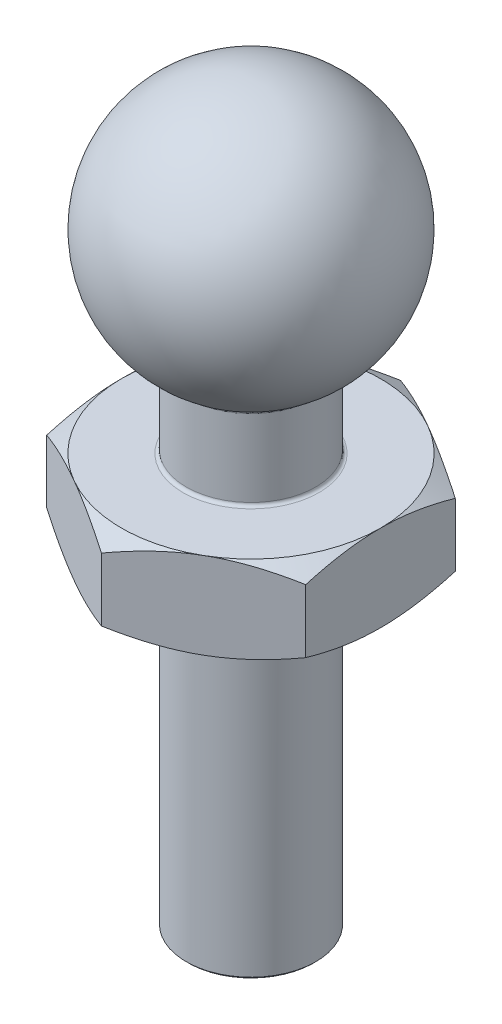
ISO-10303-21;
HEADER;
FILE_DESCRIPTION(('STEP AP214'),'2;1');
FILE_NAME('part.step','',(''),(''),'','','');
FILE_SCHEMA(('AUTOMOTIVE_DESIGN { 1 0 10303 214 1 1 1 1 }'));
ENDSEC;
DATA;
#1=APPLICATION_CONTEXT('core data for automotive mechanical design processes');
#2=APPLICATION_PROTOCOL_DEFINITION('international standard','automotive_design',2000,#1);
#3=PRODUCT_CONTEXT('',#1,'mechanical');
#4=PRODUCT('Part','Part','',(#3));
#5=PRODUCT_RELATED_PRODUCT_CATEGORY('part','',(#4));
#6=PRODUCT_DEFINITION_FORMATION('','',#4);
#7=PRODUCT_DEFINITION_CONTEXT('part definition',#1,'design');
#8=PRODUCT_DEFINITION('design','',#6,#7);
#9=PRODUCT_DEFINITION_SHAPE('','',#8);
#10=(LENGTH_UNIT() NAMED_UNIT(*) SI_UNIT(.MILLI.,.METRE.));
#11=(NAMED_UNIT(*) PLANE_ANGLE_UNIT() SI_UNIT($,.RADIAN.));
#12=(NAMED_UNIT(*) SI_UNIT($,.STERADIAN.) SOLID_ANGLE_UNIT());
#13=UNCERTAINTY_MEASURE_WITH_UNIT(LENGTH_MEASURE(1.E-05),#10,'distance_accuracy_value','');
#14=(GEOMETRIC_REPRESENTATION_CONTEXT(3) GLOBAL_UNCERTAINTY_ASSIGNED_CONTEXT((#13)) GLOBAL_UNIT_ASSIGNED_CONTEXT((#10,
#11,#12)) REPRESENTATION_CONTEXT('',''));
#15=CARTESIAN_POINT('',(0.,0.,0.));
#16=DIRECTION('',(0.,0.,1.));
#17=DIRECTION('',(1.,0.,0.));
#18=AXIS2_PLACEMENT_3D('',#15,#16,#17);
#19=CARTESIAN_POINT('',(-3.,9.5,-1.73205080756888));
#20=DIRECTION('',(1.,0.,0.));
#21=DIRECTION('',(0.,0.,-1.));
#22=AXIS2_PLACEMENT_3D('',#19,#20,#21);
#23=PLANE('',#22);
#24=CARTESIAN_POINT('',(-3.,7.49669275597267,-5.73225080756888));
#25=CARTESIAN_POINT('',(-3.,7.56535762873895,-5.59799811373669));
#26=CARTESIAN_POINT('',(-3.,7.63362658074956,-5.46354106552017));
#27=CARTESIAN_POINT('',(-3.,7.7691751977503,-5.19412594711895));
#28=CARTESIAN_POINT('',(-3.,7.83645484167597,-5.05916786634262));
#29=CARTESIAN_POINT('',(-3.,7.96993872408742,-4.78843231789163));
#30=CARTESIAN_POINT('',(-3.,8.0361409223391,-4.65265384244874));
#31=CARTESIAN_POINT('',(-3.,8.16708055525372,-4.38038885038151));
#32=CARTESIAN_POINT('',(-3.,8.23181796851999,-4.24390232345014));
#33=CARTESIAN_POINT('',(-3.,8.36273075239076,-3.96310511366176));
#34=CARTESIAN_POINT('',(-3.,8.42881132731156,-3.81875010473635));
#35=CARTESIAN_POINT('',(-3.,8.55842928727965,-3.52890389215656));
#36=CARTESIAN_POINT('',(-3.,8.62196674541402,-3.38341272129836));
#37=CARTESIAN_POINT('',(-3.,8.74573518476893,-3.0911428032025));
#38=CARTESIAN_POINT('',(-3.,8.80596844827942,-2.94436502804428));
#39=CARTESIAN_POINT('',(-3.,8.92221294586851,-2.64909731827644));
#40=CARTESIAN_POINT('',(-3.,8.97822314680859,-2.50060697487877));
#41=CARTESIAN_POINT('',(-3.,9.09420348606466,-2.17495473766773));
#42=CARTESIAN_POINT('',(-3.,9.15309774811246,-1.99740334689548));
#43=CARTESIAN_POINT('',(-3.,9.26029523419006,-1.63917764376158));
#44=CARTESIAN_POINT('',(-3.,9.30860404614459,-1.45850503366086));
#45=CARTESIAN_POINT('',(-3.,9.39023263279609,-1.09720914532956));
#46=CARTESIAN_POINT('',(-3.,9.42381477693698,-0.916647599895754));
#47=CARTESIAN_POINT('',(-3.,9.46126742176692,-0.644079261802784));
#48=CARTESIAN_POINT('',(-3.,9.47159787377878,-0.552943422867091));
#49=CARTESIAN_POINT('',(-3.,9.48763454600052,-0.370270654947725));
#50=CARTESIAN_POINT('',(-3.,9.49334144079801,-0.278733786435306));
#51=CARTESIAN_POINT('',(-3.,9.49996614854262,-0.094407851772205));
#52=CARTESIAN_POINT('',(-3.,9.5008268616344,-0.00161671746075657));
#53=CARTESIAN_POINT('',(-3.,9.49757525562797,0.183877598413804));
#54=CARTESIAN_POINT('',(-3.,9.49346292019229,0.276580779686972));
#55=CARTESIAN_POINT('',(-3.,9.48041370767168,0.461668088480519));
#56=CARTESIAN_POINT('',(-3.,9.47147558711607,0.554052127589447));
#57=CARTESIAN_POINT('',(-3.,9.4490819835307,0.738276464049778));
#58=CARTESIAN_POINT('',(-3.,9.43562578745625,0.830116673244047));
#59=CARTESIAN_POINT('',(-3.,9.38848678345653,1.1081241349506));
#60=CARTESIAN_POINT('',(-3.,9.34831083516922,1.2932028927465));
#61=CARTESIAN_POINT('',(-3.,9.25483304091392,1.65992833453579));
#62=CARTESIAN_POINT('',(-3.,9.2015281748169,1.8415742184766));
#63=CARTESIAN_POINT('',(-3.,9.09001482170302,2.18718321983853));
#64=CARTESIAN_POINT('',(-3.,9.03254960886738,2.35139002090274));
#65=CARTESIAN_POINT('',(-3.,8.91157770593576,2.67757637701536));
#66=CARTESIAN_POINT('',(-3.,8.84806982210383,2.83955548471668));
#67=CARTESIAN_POINT('',(-3.,8.71649668995848,3.16180541641892));
#68=CARTESIAN_POINT('',(-3.,8.64842746398322,3.32207460435457));
#69=CARTESIAN_POINT('',(-3.,8.50888164672137,3.64112437712565));
#70=CARTESIAN_POINT('',(-3.,8.43740489080743,3.79990488959462));
#71=CARTESIAN_POINT('',(-3.,8.29572041514807,4.10783154121877));
#72=CARTESIAN_POINT('',(-3.,8.22564804300012,4.25704019529893));
#73=CARTESIAN_POINT('',(-3.,8.0836551872923,4.55457880885657));
#74=CARTESIAN_POINT('',(-3.,8.01173465191385,4.70290874355283));
#75=CARTESIAN_POINT('',(-3.,7.86663085724281,4.99841900754648));
#76=CARTESIAN_POINT('',(-3.,7.79345182235509,5.14560141584992));
#77=CARTESIAN_POINT('',(-3.,7.64590152942626,5.43935321353677));
#78=CARTESIAN_POINT('',(-3.,7.57153036655204,5.58592265068707));
#79=CARTESIAN_POINT('',(-3.,7.49669275597267,5.73225080756888));
#80=B_SPLINE_CURVE_WITH_KNOTS('',3,(#24,#25,#26,#27,#28,#29,#30,#31,#32,#33,#34,#35,#36,#37,#38,
#39,#40,#41,#42,#43,#44,#45,#46,#47,#48,#49,#50,#51,#52,#53,#54,#55,#56,#57,#58,#59,#60,#61,#62,
#63,#64,#65,#66,#67,#68,#69,#70,#71,#72,#73,#74,#75,#76,#77,#78,#79),.UNSPECIFIED.,.F.,.F.,(4,2,
2,2,2,2,2,2,2,2,2,2,2,2,2,2,2,2,2,2,2,2,2,2,2,2,2,4),(0.,0.452382016001322,0.904773650265349,
1.35794045354517,1.81111387213612,2.2873771437625,2.76362671813268,3.23954308217786,
3.71557550010852,4.27652369616462,4.83717505756687,5.38738613645124,5.66244417939779,
5.937462083513,6.21571369559986,6.4939662218021,6.77229048018743,7.05065868449287,
7.61810965270507,8.18569127741244,8.70745206667822,9.2293161451901,9.75164138486645,
10.2739918851653,10.7685068932809,11.2630357817083,11.756143015984,12.2492110799155),.UNSPECIFIED.);
#81=CARTESIAN_POINT('',(-3.,9.23205080756888,-1.73205080756888));
#82=VERTEX_POINT('',#81);
#83=CARTESIAN_POINT('',(-3.,9.5,0.));
#84=VERTEX_POINT('',#83);
#85=EDGE_CURVE('E230',#82,#84,#80,.T.);
#86=ORIENTED_EDGE('',*,*,#85,.F.);
#87=DIRECTION('',(0.,-1.,0.));
#88=VECTOR('',#87,1.);
#89=CARTESIAN_POINT('',(-3.,9.5,-1.73205080756888));
#90=LINE('',#89,#88);
#91=CARTESIAN_POINT('',(-3.,7.7679491924311,-1.73205080756891));
#92=VERTEX_POINT('',#91);
#93=EDGE_CURVE('E176',#82,#92,#90,.T.);
#94=ORIENTED_EDGE('',*,*,#93,.T.);
#95=CARTESIAN_POINT('',(-3.,9.50330724402733,5.73225080756888));
#96=CARTESIAN_POINT('',(-3.,9.43464237126105,5.59799811373669));
#97=CARTESIAN_POINT('',(-3.,9.36637341925044,5.46354106552017));
#98=CARTESIAN_POINT('',(-3.,9.2308248022497,5.19412594711895));
#99=CARTESIAN_POINT('',(-3.,9.16354515832403,5.05916786634261));
#100=CARTESIAN_POINT('',(-3.,9.03006127591258,4.78843231789162));
#101=CARTESIAN_POINT('',(-3.,8.9638590776609,4.65265384244874));
#102=CARTESIAN_POINT('',(-3.,8.83291944474628,4.38038885038151));
#103=CARTESIAN_POINT('',(-3.,8.76818203148001,4.24390232345014));
#104=CARTESIAN_POINT('',(-3.,8.63726924760924,3.96310511366176));
#105=CARTESIAN_POINT('',(-3.,8.57118867268844,3.81875010473635));
#106=CARTESIAN_POINT('',(-3.,8.44157071272035,3.52890389215656));
#107=CARTESIAN_POINT('',(-3.,8.37803325458598,3.38341272129836));
#108=CARTESIAN_POINT('',(-3.,8.25426481523107,3.0911428032025));
#109=CARTESIAN_POINT('',(-3.,8.19403155172058,2.94436502804428));
#110=CARTESIAN_POINT('',(-3.,8.07778705413149,2.64909731827644));
#111=CARTESIAN_POINT('',(-3.,8.02177685319141,2.50060697487877));
#112=CARTESIAN_POINT('',(-3.,7.90579651393534,2.17495473766773));
#113=CARTESIAN_POINT('',(-3.,7.84690225188754,1.99740334689548));
#114=CARTESIAN_POINT('',(-3.,7.73970476580994,1.63917764376158));
#115=CARTESIAN_POINT('',(-3.,7.69139595385541,1.45850503366086));
#116=CARTESIAN_POINT('',(-3.,7.60976736720391,1.09720914532956));
#117=CARTESIAN_POINT('',(-3.,7.57618522306301,0.916647599895755));
#118=CARTESIAN_POINT('',(-3.,7.53873257823308,0.644079261802785));
#119=CARTESIAN_POINT('',(-3.,7.52840212622122,0.552943422867092));
#120=CARTESIAN_POINT('',(-3.,7.51236545399948,0.370270654947726));
#121=CARTESIAN_POINT('',(-3.,7.50665855920199,0.278733786435307));
#122=CARTESIAN_POINT('',(-3.,7.50003385145738,0.0944078517722066));
#123=CARTESIAN_POINT('',(-3.,7.4991731383656,0.00161671746075791));
#124=CARTESIAN_POINT('',(-3.,7.50242474437203,-0.183877598413803));
#125=CARTESIAN_POINT('',(-3.,7.50653707980771,-0.27658077968697));
#126=CARTESIAN_POINT('',(-3.,7.51958629232832,-0.461668088480517));
#127=CARTESIAN_POINT('',(-3.,7.52852441288393,-0.554052127589444));
#128=CARTESIAN_POINT('',(-3.,7.5509180164693,-0.738276464049775));
#129=CARTESIAN_POINT('',(-3.,7.56437421254374,-0.830116673244044));
#130=CARTESIAN_POINT('',(-3.,7.61151321654347,-1.1081241349506));
#131=CARTESIAN_POINT('',(-3.,7.65168916483078,-1.29320289274649));
#132=CARTESIAN_POINT('',(-3.,7.74516695908608,-1.65992833453579));
#133=CARTESIAN_POINT('',(-3.,7.79847182518309,-1.8415742184766));
#134=CARTESIAN_POINT('',(-3.,7.90998517829698,-2.18718321983853));
#135=CARTESIAN_POINT('',(-3.,7.96745039113262,-2.35139002090274));
#136=CARTESIAN_POINT('',(-3.,8.08842229406423,-2.67757637701535));
#137=CARTESIAN_POINT('',(-3.,8.15193017789617,-2.83955548471668));
#138=CARTESIAN_POINT('',(-3.,8.28350331004152,-3.16180541641892));
#139=CARTESIAN_POINT('',(-3.,8.35157253601677,-3.32207460435457));
#140=CARTESIAN_POINT('',(-3.,8.49111835327863,-3.64112437712565));
#141=CARTESIAN_POINT('',(-3.,8.56259510919257,-3.79990488959461));
#142=CARTESIAN_POINT('',(-3.,8.70427958485193,-4.10783154121877));
#143=CARTESIAN_POINT('',(-3.,8.77435195699988,-4.25704019529893));
#144=CARTESIAN_POINT('',(-3.,8.9163448127077,-4.55457880885657));
#145=CARTESIAN_POINT('',(-3.,8.98826534808616,-4.70290874355283));
#146=CARTESIAN_POINT('',(-3.,9.13336914275719,-4.99841900754647));
#147=CARTESIAN_POINT('',(-3.,9.20654817764491,-5.14560141584992));
#148=CARTESIAN_POINT('',(-3.,9.35409847057374,-5.43935321353677));
#149=CARTESIAN_POINT('',(-3.,9.42846963344796,-5.58592265068707));
#150=CARTESIAN_POINT('',(-3.,9.50330724402733,-5.73225080756888));
#151=B_SPLINE_CURVE_WITH_KNOTS('',3,(#95,#96,#97,#98,#99,#100,#101,#102,#103,#104,#105,#106,
#107,#108,#109,#110,#111,#112,#113,#114,#115,#116,#117,#118,#119,#120,#121,#122,#123,#124,#125,
#126,#127,#128,#129,#130,#131,#132,#133,#134,#135,#136,#137,#138,#139,#140,#141,#142,#143,#144,
#145,#146,#147,#148,#149,#150),.UNSPECIFIED.,.F.,.F.,(4,2,2,2,2,2,2,2,2,2,2,2,2,2,2,2,2,2,2,2,2,
2,2,2,2,2,2,4),(0.,0.452382016001321,0.90477365026535,1.35794045354517,1.81111387213612,
2.2873771437625,2.76362671813268,3.23954308217786,3.71557550010852,4.27652369616462,
4.83717505756687,5.38738613645124,5.66244417939779,5.937462083513,6.21571369559986,
6.4939662218021,6.77229048018743,7.05065868449287,7.61810965270507,8.18569127741243,
8.70745206667821,9.2293161451901,9.75164138486645,10.2739918851653,10.7685068932809,
11.2630357817083,11.756143015984,12.2492110799155),.UNSPECIFIED.);
#152=CARTESIAN_POINT('',(-3.,7.5,0.));
#153=VERTEX_POINT('',#152);
#154=EDGE_CURVE('E237',#153,#92,#151,.T.);
#155=ORIENTED_EDGE('',*,*,#154,.F.);
#156=CARTESIAN_POINT('',(-3.,7.76794919243112,1.73205080756888));
#157=VERTEX_POINT('',#156);
#158=EDGE_CURVE('E244',#157,#153,#151,.T.);
#159=ORIENTED_EDGE('',*,*,#158,.F.);
#160=DIRECTION('',(0.,-1.,0.));
#161=VECTOR('',#160,1.);
#162=CARTESIAN_POINT('',(-3.,9.5,1.73205080756888));
#163=LINE('',#162,#161);
#164=CARTESIAN_POINT('',(-3.,9.23205080756888,1.73205080756888));
#165=VERTEX_POINT('',#164);
#166=EDGE_CURVE('E259',#165,#157,#163,.T.);
#167=ORIENTED_EDGE('',*,*,#166,.F.);
#168=EDGE_CURVE('E161',#84,#165,#80,.T.);
#169=ORIENTED_EDGE('',*,*,#168,.F.);
#170=EDGE_LOOP('',(#86,#94,#155,#159,#167,#169));
#171=FACE_BOUND('',#170,.T.);
#172=ADVANCED_FACE('F38',(#171),#23,.F.);
#173=CARTESIAN_POINT('',(0.,9.5,-3.46410161513776));
#174=DIRECTION('',(0.5,0.,0.866025403784439));
#175=DIRECTION('',(0.866025403784438,0.,-0.5));
#176=AXIS2_PLACEMENT_3D('',#173,#174,#175);
#177=PLANE('',#176);
#178=CARTESIAN_POINT('',(0.00020000000000006,9.23198413756899,-3.46421708519159));
#179=CARTESIAN_POINT('',(-0.131635206588332,9.27594629554769,-3.38810199317915));
#180=CARTESIAN_POINT('',(-0.264608405355249,9.31592841370737,-3.31132988107607));
#181=CARTESIAN_POINT('',(-0.532857420002056,9.38571791955454,-3.15645624025988));
#182=CARTESIAN_POINT('',(-0.668138002634342,9.41550061773462,-3.078351959461));
#183=CARTESIAN_POINT('',(-0.937022602096483,9.46186216078874,-2.92311136358059));
#184=CARTESIAN_POINT('',(-1.07058524542946,9.47874955887705,-2.84599893549861));
#185=CARTESIAN_POINT('',(-1.33833905729569,9.49891035755148,-2.6914112001411));
#186=CARTESIAN_POINT('',(-1.47252925247984,9.50220045221892,-2.61393645482892));
#187=CARTESIAN_POINT('',(-1.72327559769581,9.49535946911461,-2.46916798492017));
#188=CARTESIAN_POINT('',(-1.83986926497268,9.48690808580738,-2.40185259973206));
#189=CARTESIAN_POINT('',(-2.07229698497464,9.46012105699296,-2.2676603930218));
#190=CARTESIAN_POINT('',(-2.18813023365133,9.44177625913829,-2.2007840357172));
#191=CARTESIAN_POINT('',(-2.42103725705637,9.39591524914667,-2.06631510305815));
#192=CARTESIAN_POINT('',(-2.53808155051394,9.36820461473692,-1.99873954872331));
#193=CARTESIAN_POINT('',(-2.77042435049913,9.3053122048626,-1.86459637060759));
#194=CARTESIAN_POINT('',(-2.88572583417111,9.27014520897844,-1.79802702797161));
#195=CARTESIAN_POINT('',(-3.0002,9.23198413756899,-1.73193533751504));
#196=B_SPLINE_CURVE_WITH_KNOTS('',3,(#178,#179,#180,#181,#182,#183,#184,#185,#186,#187,#188,
#189,#190,#191,#192,#193,#194,#195),.UNSPECIFIED.,.F.,.F.,(4,2,2,2,2,2,2,2,4),(0.,
0.475539830103041,0.952222784107964,1.41710776961288,1.88142182298026,2.28572436316091,
2.69040156475039,3.10405572063576,3.5168974940707),.UNSPECIFIED.);
#197=CARTESIAN_POINT('',(0.,9.23205080756888,-3.46410161513776));
#198=VERTEX_POINT('',#197);
#199=CARTESIAN_POINT('',(-1.5,9.5,-2.59807621135332));
#200=VERTEX_POINT('',#199);
#201=EDGE_CURVE('E156',#198,#200,#196,.T.);
#202=ORIENTED_EDGE('',*,*,#201,.F.);
#203=DIRECTION('',(0.,-1.,0.));
#204=VECTOR('',#203,1.);
#205=CARTESIAN_POINT('',(0.,9.5,-3.46410161513776));
#206=LINE('',#205,#204);
#207=CARTESIAN_POINT('',(0.,7.76794919243112,-3.46410161513776));
#208=VERTEX_POINT('',#207);
#209=EDGE_CURVE('E256',#198,#208,#206,.T.);
#210=ORIENTED_EDGE('',*,*,#209,.T.);
#211=CARTESIAN_POINT('',(-3.0002,7.76801586243101,-1.73193533751504));
#212=CARTESIAN_POINT('',(-2.86836479341167,7.72405370445231,-1.80805042952748));
#213=CARTESIAN_POINT('',(-2.73539159464475,7.68407158629263,-1.88482254163057));
#214=CARTESIAN_POINT('',(-2.46714257999795,7.61428208044547,-2.03969618244675));
#215=CARTESIAN_POINT('',(-2.33186199736566,7.58449938226538,-2.11780046324563));
#216=CARTESIAN_POINT('',(-2.06297739790352,7.53813783921126,-2.27304105912605));
#217=CARTESIAN_POINT('',(-1.92941475457054,7.52125044112295,-2.35015348720802));
#218=CARTESIAN_POINT('',(-1.66166094270431,7.50108964244852,-2.50474122256553));
#219=CARTESIAN_POINT('',(-1.52747074752016,7.49779954778108,-2.58221596787771));
#220=CARTESIAN_POINT('',(-1.27672440230419,7.50464053088539,-2.72698443778646));
#221=CARTESIAN_POINT('',(-1.16013073502732,7.51309191419262,-2.79429982297457));
#222=CARTESIAN_POINT('',(-0.927703015025364,7.53987894300703,-2.92849202968483));
#223=CARTESIAN_POINT('',(-0.811869766348669,7.55822374086171,-2.99536838698943));
#224=CARTESIAN_POINT('',(-0.578962742943633,7.60408475085333,-3.12983731964848));
#225=CARTESIAN_POINT('',(-0.46191844948606,7.63179538526308,-3.19741287398332));
#226=CARTESIAN_POINT('',(-0.229575649500876,7.6946877951374,-3.33155605209904));
#227=CARTESIAN_POINT('',(-0.114274165828894,7.72985479102156,-3.39812539473502));
#228=CARTESIAN_POINT('',(0.000199999999999851,7.76801586243101,-3.46421708519159));
#229=B_SPLINE_CURVE_WITH_KNOTS('',3,(#211,#212,#213,#214,#215,#216,#217,#218,#219,#220,#221,
#222,#223,#224,#225,#226,#227,#228),.UNSPECIFIED.,.F.,.F.,(4,2,2,2,2,2,2,2,4),(0.,
0.47553983010304,0.952222784107964,1.41710776961288,1.88142182298026,2.28572436316091,
2.69040156475039,3.10405572063576,3.5168974940707),.UNSPECIFIED.);
#230=CARTESIAN_POINT('',(-1.5,7.5,-2.59807621135332));
#231=VERTEX_POINT('',#230);
#232=EDGE_CURVE('E318',#231,#208,#229,.T.);
#233=ORIENTED_EDGE('',*,*,#232,.F.);
#234=EDGE_CURVE('E307',#92,#231,#229,.T.);
#235=ORIENTED_EDGE('',*,*,#234,.F.);
#236=ORIENTED_EDGE('',*,*,#93,.F.);
#237=EDGE_CURVE('E149',#200,#82,#196,.T.);
#238=ORIENTED_EDGE('',*,*,#237,.F.);
#239=EDGE_LOOP('',(#202,#210,#233,#235,#236,#238));
#240=FACE_BOUND('',#239,.T.);
#241=ADVANCED_FACE('F174',(#240),#177,.F.);
#242=CARTESIAN_POINT('',(3.,9.5,-1.73205080756888));
#243=DIRECTION('',(-0.5,0.,0.866025403784439));
#244=DIRECTION('',(0.866025403784439,0.,0.5));
#245=AXIS2_PLACEMENT_3D('',#242,#243,#244);
#246=PLANE('',#245);
#247=CARTESIAN_POINT('',(3.0002,9.23198413756899,-1.73193533751504));
#248=CARTESIAN_POINT('',(2.86836479341167,9.27594629554769,-1.80805042952749));
#249=CARTESIAN_POINT('',(2.73539159464475,9.31592841370737,-1.88482254163057));
#250=CARTESIAN_POINT('',(2.46714257999794,9.38571791955454,-2.03969618244676));
#251=CARTESIAN_POINT('',(2.33186199736566,9.41550061773462,-2.11780046324564));
#252=CARTESIAN_POINT('',(2.06297739790352,9.46186216078874,-2.27304105912605));
#253=CARTESIAN_POINT('',(1.92941475457054,9.47874955887705,-2.35015348720802));
#254=CARTESIAN_POINT('',(1.66166094270431,9.49891035755148,-2.50474122256554));
#255=CARTESIAN_POINT('',(1.52747074752015,9.50220045221892,-2.58221596787772));
#256=CARTESIAN_POINT('',(1.27672440230419,9.49535946911461,-2.72698443778647));
#257=CARTESIAN_POINT('',(1.16013073502732,9.48690808580738,-2.79429982297457));
#258=CARTESIAN_POINT('',(0.927703015025362,9.46012105699296,-2.92849202968484));
#259=CARTESIAN_POINT('',(0.811869766348668,9.44177625913829,-2.99536838698943));
#260=CARTESIAN_POINT('',(0.578962742943632,9.39591524914667,-3.12983731964849));
#261=CARTESIAN_POINT('',(0.461918449486059,9.36820461473692,-3.19741287398333));
#262=CARTESIAN_POINT('',(0.229575649500875,9.3053122048626,-3.33155605209904));
#263=CARTESIAN_POINT('',(0.114274165828893,9.27014520897844,-3.39812539473502));
#264=CARTESIAN_POINT('',(-0.00019999999999999,9.23198413756899,-3.46421708519159));
#265=B_SPLINE_CURVE_WITH_KNOTS('',3,(#247,#248,#249,#250,#251,#252,#253,#254,#255,#256,#257,
#258,#259,#260,#261,#262,#263,#264),.UNSPECIFIED.,.F.,.F.,(4,2,2,2,2,2,2,2,4),(0.,
0.475539830103041,0.952222784107964,1.41710776961288,1.88142182298026,2.28572436316091,
2.69040156475039,3.10405572063576,3.5168974940707),.UNSPECIFIED.);
#266=CARTESIAN_POINT('',(3.,9.2320508075689,-1.73205080756891));
#267=VERTEX_POINT('',#266);
#268=CARTESIAN_POINT('',(1.5,9.5,-2.59807621135332));
#269=VERTEX_POINT('',#268);
#270=EDGE_CURVE('E132',#267,#269,#265,.T.);
#271=ORIENTED_EDGE('',*,*,#270,.F.);
#272=DIRECTION('',(0.,-1.,0.));
#273=VECTOR('',#272,1.);
#274=CARTESIAN_POINT('',(3.,9.5,-1.73205080756888));
#275=LINE('',#274,#273);
#276=CARTESIAN_POINT('',(3.,7.76794919243112,-1.73205080756888));
#277=VERTEX_POINT('',#276);
#278=EDGE_CURVE('E154',#267,#277,#275,.T.);
#279=ORIENTED_EDGE('',*,*,#278,.T.);
#280=CARTESIAN_POINT('',(-0.000199999999999994,7.76801586243101,-3.46421708519159));
#281=CARTESIAN_POINT('',(0.131635206588332,7.72405370445231,-3.38810199317915));
#282=CARTESIAN_POINT('',(0.264608405355249,7.68407158629263,-3.31132988107606));
#283=CARTESIAN_POINT('',(0.532857420002056,7.61428208044547,-3.15645624025988));
#284=CARTESIAN_POINT('',(0.668138002634342,7.58449938226538,-3.078351959461));
#285=CARTESIAN_POINT('',(0.937022602096484,7.53813783921126,-2.92311136358059));
#286=CARTESIAN_POINT('',(1.07058524542946,7.52125044112295,-2.84599893549862));
#287=CARTESIAN_POINT('',(1.33833905729569,7.50108964244852,-2.6914112001411));
#288=CARTESIAN_POINT('',(1.47252925247984,7.49779954778108,-2.61393645482892));
#289=CARTESIAN_POINT('',(1.72327559769581,7.50464053088539,-2.46916798492017));
#290=CARTESIAN_POINT('',(1.83986926497268,7.51309191419262,-2.40185259973206));
#291=CARTESIAN_POINT('',(2.07229698497464,7.53987894300704,-2.2676603930218));
#292=CARTESIAN_POINT('',(2.18813023365133,7.55822374086171,-2.2007840357172));
#293=CARTESIAN_POINT('',(2.42103725705637,7.60408475085333,-2.06631510305815));
#294=CARTESIAN_POINT('',(2.53808155051394,7.63179538526308,-1.99873954872331));
#295=CARTESIAN_POINT('',(2.77042435049912,7.6946877951374,-1.86459637060759));
#296=CARTESIAN_POINT('',(2.88572583417111,7.72985479102156,-1.79802702797161));
#297=CARTESIAN_POINT('',(3.0002,7.76801586243101,-1.73193533751504));
#298=B_SPLINE_CURVE_WITH_KNOTS('',3,(#280,#281,#282,#283,#284,#285,#286,#287,#288,#289,#290,
#291,#292,#293,#294,#295,#296,#297),.UNSPECIFIED.,.F.,.F.,(4,2,2,2,2,2,2,2,4),(0.,
0.475539830103041,0.952222784107964,1.41710776961288,1.88142182298026,2.28572436316091,
2.69040156475039,3.10405572063576,3.5168974940707),.UNSPECIFIED.);
#299=CARTESIAN_POINT('',(1.5,7.5,-2.59807621135332));
#300=VERTEX_POINT('',#299);
#301=EDGE_CURVE('E273',#300,#277,#298,.T.);
#302=ORIENTED_EDGE('',*,*,#301,.F.);
#303=EDGE_CURVE('E312',#208,#300,#298,.T.);
#304=ORIENTED_EDGE('',*,*,#303,.F.);
#305=ORIENTED_EDGE('',*,*,#209,.F.);
#306=EDGE_CURVE('E155',#269,#198,#265,.T.);
#307=ORIENTED_EDGE('',*,*,#306,.F.);
#308=EDGE_LOOP('',(#271,#279,#302,#304,#305,#307));
#309=FACE_BOUND('',#308,.T.);
#310=ADVANCED_FACE('F283',(#309),#246,.F.);
#311=CARTESIAN_POINT('',(3.,9.5,1.73205080756888));
#312=DIRECTION('',(-1.,0.,0.));
#313=DIRECTION('',(0.,0.,1.));
#314=AXIS2_PLACEMENT_3D('',#311,#312,#313);
#315=PLANE('',#314);
#316=CARTESIAN_POINT('',(3.,7.49669275597267,5.73225080756888));
#317=CARTESIAN_POINT('',(3.,7.56535762873894,5.59799811373669));
#318=CARTESIAN_POINT('',(3.,7.63362658074956,5.46354106552018));
#319=CARTESIAN_POINT('',(3.,7.7691751977503,5.19412594711896));
#320=CARTESIAN_POINT('',(3.,7.83645484167597,5.05916786634262));
#321=CARTESIAN_POINT('',(3.,7.96993872408742,4.78843231789163));
#322=CARTESIAN_POINT('',(3.,8.0361409223391,4.65265384244875));
#323=CARTESIAN_POINT('',(3.,8.16708055525372,4.38038885038152));
#324=CARTESIAN_POINT('',(3.,8.23181796851999,4.24390232345015));
#325=CARTESIAN_POINT('',(3.,8.36273075239076,3.96310511366176));
#326=CARTESIAN_POINT('',(3.,8.42881132731156,3.81875010473635));
#327=CARTESIAN_POINT('',(3.,8.55842928727965,3.52890389215656));
#328=CARTESIAN_POINT('',(3.,8.62196674541402,3.38341272129836));
#329=CARTESIAN_POINT('',(3.,8.74573518476893,3.0911428032025));
#330=CARTESIAN_POINT('',(3.,8.80596844827941,2.94436502804428));
#331=CARTESIAN_POINT('',(3.,8.92221294586851,2.64909731827644));
#332=CARTESIAN_POINT('',(3.,8.97822314680859,2.50060697487877));
#333=CARTESIAN_POINT('',(3.,9.09420348606466,2.17495473766773));
#334=CARTESIAN_POINT('',(3.,9.15309774811247,1.99740334689548));
#335=CARTESIAN_POINT('',(3.,9.26029523419006,1.63917764376158));
#336=CARTESIAN_POINT('',(3.,9.30860404614459,1.45850503366086));
#337=CARTESIAN_POINT('',(3.,9.39023263279609,1.09720914532956));
#338=CARTESIAN_POINT('',(3.,9.42381477693698,0.916647599895758));
#339=CARTESIAN_POINT('',(3.,9.46126742176692,0.644079261802788));
#340=CARTESIAN_POINT('',(3.,9.47159787377878,0.552943422867095));
#341=CARTESIAN_POINT('',(3.,9.48763454600052,0.370270654947728));
#342=CARTESIAN_POINT('',(3.,9.49334144079801,0.27873378643531));
#343=CARTESIAN_POINT('',(3.,9.49996614854262,0.0944078517722094));
#344=CARTESIAN_POINT('',(3.,9.5008268616344,0.00161671746076116));
#345=CARTESIAN_POINT('',(3.,9.49757525562797,-0.183877598413799));
#346=CARTESIAN_POINT('',(3.,9.49346292019229,-0.276580779686967));
#347=CARTESIAN_POINT('',(3.,9.48041370767168,-0.461668088480513));
#348=CARTESIAN_POINT('',(3.,9.47147558711607,-0.554052127589442));
#349=CARTESIAN_POINT('',(3.,9.4490819835307,-0.738276464049772));
#350=CARTESIAN_POINT('',(3.,9.43562578745626,-0.830116673244042));
#351=CARTESIAN_POINT('',(3.,9.38848678345653,-1.1081241349506));
#352=CARTESIAN_POINT('',(3.,9.34831083516922,-1.29320289274649));
#353=CARTESIAN_POINT('',(3.,9.25483304091392,-1.65992833453579));
#354=CARTESIAN_POINT('',(3.,9.20152817481691,-1.8415742184766));
#355=CARTESIAN_POINT('',(3.,9.09001482170302,-2.18718321983853));
#356=CARTESIAN_POINT('',(3.,9.03254960886738,-2.35139002090273));
#357=CARTESIAN_POINT('',(3.,8.91157770593577,-2.67757637701535));
#358=CARTESIAN_POINT('',(3.,8.84806982210383,-2.83955548471668));
#359=CARTESIAN_POINT('',(3.,8.71649668995848,-3.16180541641892));
#360=CARTESIAN_POINT('',(3.,8.64842746398323,-3.32207460435457));
#361=CARTESIAN_POINT('',(3.,8.50888164672137,-3.64112437712565));
#362=CARTESIAN_POINT('',(3.,8.43740489080743,-3.79990488959462));
#363=CARTESIAN_POINT('',(3.,8.29572041514807,-4.10783154121877));
#364=CARTESIAN_POINT('',(3.,8.22564804300012,-4.25704019529893));
#365=CARTESIAN_POINT('',(3.,8.0836551872923,-4.55457880885657));
#366=CARTESIAN_POINT('',(3.,8.01173465191385,-4.70290874355283));
#367=CARTESIAN_POINT('',(3.,7.86663085724281,-4.99841900754648));
#368=CARTESIAN_POINT('',(3.,7.79345182235509,-5.14560141584992));
#369=CARTESIAN_POINT('',(3.,7.64590152942625,-5.43935321353678));
#370=CARTESIAN_POINT('',(3.,7.57153036655204,-5.58592265068708));
#371=CARTESIAN_POINT('',(3.,7.49669275597267,-5.73225080756888));
#372=B_SPLINE_CURVE_WITH_KNOTS('',3,(#316,#317,#318,#319,#320,#321,#322,#323,#324,#325,#326,
#327,#328,#329,#330,#331,#332,#333,#334,#335,#336,#337,#338,#339,#340,#341,#342,#343,#344,#345,
#346,#347,#348,#349,#350,#351,#352,#353,#354,#355,#356,#357,#358,#359,#360,#361,#362,#363,#364,
#365,#366,#367,#368,#369,#370,#371),.UNSPECIFIED.,.F.,.F.,(4,2,2,2,2,2,2,2,2,2,2,2,2,2,2,2,2,2,
2,2,2,2,2,2,2,2,2,4),(0.,0.452382016001321,0.904773650265348,1.35794045354517,1.81111387213612,
2.2873771437625,2.76362671813267,3.23954308217786,3.71557550010852,4.27652369616462,
4.83717505756687,5.38738613645124,5.66244417939779,5.937462083513,6.21571369559986,
6.4939662218021,6.77229048018743,7.05065868449287,7.61810965270507,8.18569127741243,
8.70745206667822,9.2293161451901,9.75164138486646,10.2739918851653,10.7685068932809,
11.2630357817083,11.756143015984,12.2492110799155),.UNSPECIFIED.);
#373=CARTESIAN_POINT('',(3.,9.23205080756888,1.73205080756888));
#374=VERTEX_POINT('',#373);
#375=CARTESIAN_POINT('',(3.,9.5,0.));
#376=VERTEX_POINT('',#375);
#377=EDGE_CURVE('E143',#374,#376,#372,.T.);
#378=ORIENTED_EDGE('',*,*,#377,.F.);
#379=DIRECTION('',(0.,-1.,0.));
#380=VECTOR('',#379,1.);
#381=CARTESIAN_POINT('',(3.,9.5,1.73205080756888));
#382=LINE('',#381,#380);
#383=CARTESIAN_POINT('',(3.,7.76794919243112,1.73205080756888));
#384=VERTEX_POINT('',#383);
#385=EDGE_CURVE('E253',#374,#384,#382,.T.);
#386=ORIENTED_EDGE('',*,*,#385,.T.);
#387=CARTESIAN_POINT('',(3.,9.50330724402733,-5.73225080756888));
#388=CARTESIAN_POINT('',(3.,9.43464237126106,-5.59799811373669));
#389=CARTESIAN_POINT('',(3.,9.36637341925044,-5.46354106552018));
#390=CARTESIAN_POINT('',(3.,9.2308248022497,-5.19412594711896));
#391=CARTESIAN_POINT('',(3.,9.16354515832403,-5.05916786634262));
#392=CARTESIAN_POINT('',(3.,9.03006127591258,-4.78843231789163));
#393=CARTESIAN_POINT('',(3.,8.9638590776609,-4.65265384244875));
#394=CARTESIAN_POINT('',(3.,8.83291944474628,-4.38038885038152));
#395=CARTESIAN_POINT('',(3.,8.76818203148002,-4.24390232345015));
#396=CARTESIAN_POINT('',(3.,8.63726924760925,-3.96310511366177));
#397=CARTESIAN_POINT('',(3.,8.57118867268844,-3.81875010473635));
#398=CARTESIAN_POINT('',(3.,8.44157071272035,-3.52890389215656));
#399=CARTESIAN_POINT('',(3.,8.37803325458598,-3.38341272129837));
#400=CARTESIAN_POINT('',(3.,8.25426481523107,-3.0911428032025));
#401=CARTESIAN_POINT('',(3.,8.19403155172058,-2.94436502804428));
#402=CARTESIAN_POINT('',(3.,8.07778705413149,-2.64909731827645));
#403=CARTESIAN_POINT('',(3.,8.02177685319141,-2.50060697487878));
#404=CARTESIAN_POINT('',(3.,7.90579651393534,-2.17495473766774));
#405=CARTESIAN_POINT('',(3.,7.84690225188754,-1.99740334689548));
#406=CARTESIAN_POINT('',(3.,7.73970476580994,-1.63917764376158));
#407=CARTESIAN_POINT('',(3.,7.69139595385541,-1.45850503366087));
#408=CARTESIAN_POINT('',(3.,7.60976736720391,-1.09720914532956));
#409=CARTESIAN_POINT('',(3.,7.57618522306302,-0.916647599895759));
#410=CARTESIAN_POINT('',(3.,7.53873257823308,-0.644079261802789));
#411=CARTESIAN_POINT('',(3.,7.52840212622122,-0.552943422867096));
#412=CARTESIAN_POINT('',(3.,7.51236545399948,-0.370270654947729));
#413=CARTESIAN_POINT('',(3.,7.50665855920199,-0.278733786435311));
#414=CARTESIAN_POINT('',(3.,7.50003385145738,-0.0944078517722104));
#415=CARTESIAN_POINT('',(3.,7.4991731383656,-0.00161671746076195));
#416=CARTESIAN_POINT('',(3.,7.50242474437203,0.183877598413799));
#417=CARTESIAN_POINT('',(3.,7.50653707980771,0.276580779686967));
#418=CARTESIAN_POINT('',(3.,7.51958629232832,0.461668088480513));
#419=CARTESIAN_POINT('',(3.,7.52852441288393,0.554052127589441));
#420=CARTESIAN_POINT('',(3.,7.5509180164693,0.738276464049772));
#421=CARTESIAN_POINT('',(3.,7.56437421254374,0.830116673244042));
#422=CARTESIAN_POINT('',(3.,7.61151321654347,1.1081241349506));
#423=CARTESIAN_POINT('',(3.,7.65168916483078,1.29320289274649));
#424=CARTESIAN_POINT('',(3.,7.74516695908608,1.65992833453579));
#425=CARTESIAN_POINT('',(3.,7.79847182518309,1.8415742184766));
#426=CARTESIAN_POINT('',(3.,7.90998517829698,2.18718321983853));
#427=CARTESIAN_POINT('',(3.,7.96745039113261,2.35139002090273));
#428=CARTESIAN_POINT('',(3.,8.08842229406423,2.67757637701535));
#429=CARTESIAN_POINT('',(3.,8.15193017789617,2.83955548471668));
#430=CARTESIAN_POINT('',(3.,8.28350331004152,3.16180541641892));
#431=CARTESIAN_POINT('',(3.,8.35157253601677,3.32207460435456));
#432=CARTESIAN_POINT('',(3.,8.49111835327863,3.64112437712565));
#433=CARTESIAN_POINT('',(3.,8.56259510919257,3.79990488959461));
#434=CARTESIAN_POINT('',(3.,8.70427958485193,4.10783154121876));
#435=CARTESIAN_POINT('',(3.,8.77435195699987,4.25704019529893));
#436=CARTESIAN_POINT('',(3.,8.9163448127077,4.55457880885657));
#437=CARTESIAN_POINT('',(3.,8.98826534808615,4.70290874355283));
#438=CARTESIAN_POINT('',(3.,9.13336914275719,4.99841900754647));
#439=CARTESIAN_POINT('',(3.,9.20654817764491,5.14560141584992));
#440=CARTESIAN_POINT('',(3.,9.35409847057374,5.43935321353677));
#441=CARTESIAN_POINT('',(3.,9.42846963344796,5.58592265068707));
#442=CARTESIAN_POINT('',(3.,9.50330724402733,5.73225080756888));
#443=B_SPLINE_CURVE_WITH_KNOTS('',3,(#387,#388,#389,#390,#391,#392,#393,#394,#395,#396,#397,
#398,#399,#400,#401,#402,#403,#404,#405,#406,#407,#408,#409,#410,#411,#412,#413,#414,#415,#416,
#417,#418,#419,#420,#421,#422,#423,#424,#425,#426,#427,#428,#429,#430,#431,#432,#433,#434,#435,
#436,#437,#438,#439,#440,#441,#442),.UNSPECIFIED.,.F.,.F.,(4,2,2,2,2,2,2,2,2,2,2,2,2,2,2,2,2,2,
2,2,2,2,2,2,2,2,2,4),(0.,0.452382016001323,0.90477365026535,1.35794045354517,1.81111387213612,
2.2873771437625,2.76362671813268,3.23954308217786,3.71557550010852,4.27652369616462,
4.83717505756687,5.38738613645125,5.66244417939779,5.93746208351301,6.21571369559987,
6.4939662218021,6.77229048018743,7.05065868449288,7.61810965270508,8.18569127741244,
8.70745206667822,9.2293161451901,9.75164138486646,10.2739918851653,10.7685068932809,
11.2630357817083,11.756143015984,12.2492110799155),.UNSPECIFIED.);
#444=CARTESIAN_POINT('',(3.,7.5,0.));
#445=VERTEX_POINT('',#444);
#446=EDGE_CURVE('E266',#445,#384,#443,.T.);
#447=ORIENTED_EDGE('',*,*,#446,.F.);
#448=EDGE_CURVE('E265',#277,#445,#443,.T.);
#449=ORIENTED_EDGE('',*,*,#448,.F.);
#450=ORIENTED_EDGE('',*,*,#278,.F.);
#451=EDGE_CURVE('E130',#376,#267,#372,.T.);
#452=ORIENTED_EDGE('',*,*,#451,.F.);
#453=EDGE_LOOP('',(#378,#386,#447,#449,#450,#452));
#454=FACE_BOUND('',#453,.T.);
#455=ADVANCED_FACE('F152',(#454),#315,.F.);
#456=CARTESIAN_POINT('',(0.,9.5,3.46410161513776));
#457=DIRECTION('',(-0.5,0.,-0.866025403784438));
#458=DIRECTION('',(-0.866025403784438,0.,0.5));
#459=AXIS2_PLACEMENT_3D('',#456,#457,#458);
#460=PLANE('',#459);
#461=CARTESIAN_POINT('',(-0.000200000000000046,9.23198413756899,3.46421708519159));
#462=CARTESIAN_POINT('',(0.131635206588332,9.27594629554769,3.38810199317915));
#463=CARTESIAN_POINT('',(0.264608405355249,9.31592841370737,3.31132988107606));
#464=CARTESIAN_POINT('',(0.532857420002056,9.38571791955454,3.15645624025988));
#465=CARTESIAN_POINT('',(0.668138002634342,9.41550061773462,3.078351959461));
#466=CARTESIAN_POINT('',(0.937022602096483,9.46186216078874,2.92311136358059));
#467=CARTESIAN_POINT('',(1.07058524542946,9.47874955887705,2.84599893549861));
#468=CARTESIAN_POINT('',(1.33833905729569,9.49891035755148,2.6914112001411));
#469=CARTESIAN_POINT('',(1.47252925247984,9.50220045221892,2.61393645482892));
#470=CARTESIAN_POINT('',(1.72327559769581,9.49535946911461,2.46916798492017));
#471=CARTESIAN_POINT('',(1.83986926497268,9.48690808580738,2.40185259973206));
#472=CARTESIAN_POINT('',(2.07229698497464,9.46012105699297,2.2676603930218));
#473=CARTESIAN_POINT('',(2.18813023365133,9.44177625913829,2.2007840357172));
#474=CARTESIAN_POINT('',(2.42103725705637,9.39591524914667,2.06631510305815));
#475=CARTESIAN_POINT('',(2.53808155051394,9.36820461473692,1.99873954872331));
#476=CARTESIAN_POINT('',(2.77042435049912,9.3053122048626,1.86459637060759));
#477=CARTESIAN_POINT('',(2.88572583417111,9.27014520897844,1.79802702797161));
#478=CARTESIAN_POINT('',(3.0002,9.23198413756899,1.73193533751504));
#479=B_SPLINE_CURVE_WITH_KNOTS('',3,(#461,#462,#463,#464,#465,#466,#467,#468,#469,#470,#471,
#472,#473,#474,#475,#476,#477,#478),.UNSPECIFIED.,.F.,.F.,(4,2,2,2,2,2,2,2,4),(0.,
0.475539830103041,0.952222784107964,1.41710776961288,1.88142182298026,2.28572436316091,
2.69040156475039,3.10405572063576,3.5168974940707),.UNSPECIFIED.);
#480=CARTESIAN_POINT('',(0.,9.23205080756888,3.46410161513776));
#481=VERTEX_POINT('',#480);
#482=CARTESIAN_POINT('',(1.5,9.5,2.59807621135332));
#483=VERTEX_POINT('',#482);
#484=EDGE_CURVE('E159',#481,#483,#479,.T.);
#485=ORIENTED_EDGE('',*,*,#484,.F.);
#486=DIRECTION('',(0.,-1.,0.));
#487=VECTOR('',#486,1.);
#488=CARTESIAN_POINT('',(0.,9.5,3.46410161513776));
#489=LINE('',#488,#487);
#490=CARTESIAN_POINT('',(0.,7.76794919243112,3.46410161513776));
#491=VERTEX_POINT('',#490);
#492=EDGE_CURVE('E251',#481,#491,#489,.T.);
#493=ORIENTED_EDGE('',*,*,#492,.T.);
#494=CARTESIAN_POINT('',(3.0002,7.76801586243101,1.73193533751504));
#495=CARTESIAN_POINT('',(2.86836479341167,7.7240537044523,1.80805042952748));
#496=CARTESIAN_POINT('',(2.73539159464475,7.68407158629263,1.88482254163057));
#497=CARTESIAN_POINT('',(2.46714257999794,7.61428208044546,2.03969618244675));
#498=CARTESIAN_POINT('',(2.33186199736566,7.58449938226538,2.11780046324563));
#499=CARTESIAN_POINT('',(2.06297739790352,7.53813783921126,2.27304105912605));
#500=CARTESIAN_POINT('',(1.92941475457054,7.52125044112295,2.35015348720802));
#501=CARTESIAN_POINT('',(1.66166094270431,7.50108964244852,2.50474122256553));
#502=CARTESIAN_POINT('',(1.52747074752016,7.49779954778108,2.58221596787771));
#503=CARTESIAN_POINT('',(1.27672440230419,7.50464053088539,2.72698443778646));
#504=CARTESIAN_POINT('',(1.16013073502732,7.51309191419262,2.79429982297457));
#505=CARTESIAN_POINT('',(0.927703015025364,7.53987894300703,2.92849202968483));
#506=CARTESIAN_POINT('',(0.811869766348669,7.55822374086171,2.99536838698943));
#507=CARTESIAN_POINT('',(0.578962742943633,7.60408475085333,3.12983731964848));
#508=CARTESIAN_POINT('',(0.46191844948606,7.63179538526308,3.19741287398332));
#509=CARTESIAN_POINT('',(0.229575649500876,7.6946877951374,3.33155605209904));
#510=CARTESIAN_POINT('',(0.114274165828894,7.72985479102156,3.39812539473502));
#511=CARTESIAN_POINT('',(-0.000200000000000149,7.76801586243101,3.46421708519159));
#512=B_SPLINE_CURVE_WITH_KNOTS('',3,(#494,#495,#496,#497,#498,#499,#500,#501,#502,#503,#504,
#505,#506,#507,#508,#509,#510,#511),.UNSPECIFIED.,.F.,.F.,(4,2,2,2,2,2,2,2,4),(0.,
0.47553983010304,0.952222784107964,1.41710776961288,1.88142182298026,2.28572436316091,
2.69040156475039,3.10405572063576,3.5168974940707),.UNSPECIFIED.);
#513=CARTESIAN_POINT('',(1.5,7.5,2.59807621135332));
#514=VERTEX_POINT('',#513);
#515=EDGE_CURVE('E274',#514,#491,#512,.T.);
#516=ORIENTED_EDGE('',*,*,#515,.F.);
#517=EDGE_CURVE('E324',#384,#514,#512,.T.);
#518=ORIENTED_EDGE('',*,*,#517,.F.);
#519=ORIENTED_EDGE('',*,*,#385,.F.);
#520=EDGE_CURVE('E146',#483,#374,#479,.T.);
#521=ORIENTED_EDGE('',*,*,#520,.F.);
#522=EDGE_LOOP('',(#485,#493,#516,#518,#519,#521));
#523=FACE_BOUND('',#522,.T.);
#524=ADVANCED_FACE('F282',(#523),#460,.F.);
#525=CARTESIAN_POINT('',(-3.,9.5,1.73205080756888));
#526=DIRECTION('',(0.5,0.,-0.866025403784439));
#527=DIRECTION('',(-0.866025403784439,0.,-0.5));
#528=AXIS2_PLACEMENT_3D('',#525,#526,#527);
#529=PLANE('',#528);
#530=CARTESIAN_POINT('',(-3.0002,9.23198413756899,1.73193533751504));
#531=CARTESIAN_POINT('',(-2.86836479341167,9.27594629554769,1.80805042952748));
#532=CARTESIAN_POINT('',(-2.73539159464475,9.31592841370737,1.88482254163057));
#533=CARTESIAN_POINT('',(-2.46714257999794,9.38571791955454,2.03969618244675));
#534=CARTESIAN_POINT('',(-2.33186199736566,9.41550061773462,2.11780046324563));
#535=CARTESIAN_POINT('',(-2.06297739790352,9.46186216078874,2.27304105912605));
#536=CARTESIAN_POINT('',(-1.92941475457054,9.47874955887705,2.35015348720802));
#537=CARTESIAN_POINT('',(-1.66166094270431,9.49891035755148,2.50474122256553));
#538=CARTESIAN_POINT('',(-1.52747074752016,9.50220045221892,2.58221596787771));
#539=CARTESIAN_POINT('',(-1.27672440230419,9.49535946911461,2.72698443778647));
#540=CARTESIAN_POINT('',(-1.16013073502732,9.48690808580738,2.79429982297457));
#541=CARTESIAN_POINT('',(-0.927703015025363,9.46012105699296,2.92849202968483));
#542=CARTESIAN_POINT('',(-0.811869766348669,9.44177625913829,2.99536838698943));
#543=CARTESIAN_POINT('',(-0.578962742943632,9.39591524914667,3.12983731964848));
#544=CARTESIAN_POINT('',(-0.461918449486059,9.36820461473692,3.19741287398332));
#545=CARTESIAN_POINT('',(-0.229575649500875,9.3053122048626,3.33155605209904));
#546=CARTESIAN_POINT('',(-0.114274165828894,9.27014520897844,3.39812539473502));
#547=CARTESIAN_POINT('',(0.000199999999999725,9.23198413756899,3.46421708519159));
#548=B_SPLINE_CURVE_WITH_KNOTS('',3,(#530,#531,#532,#533,#534,#535,#536,#537,#538,#539,#540,
#541,#542,#543,#544,#545,#546,#547),.UNSPECIFIED.,.F.,.F.,(4,2,2,2,2,2,2,2,4),(0.,
0.475539830103041,0.952222784107965,1.41710776961288,1.88142182298026,2.28572436316091,
2.69040156475039,3.10405572063576,3.5168974940707),.UNSPECIFIED.);
#549=CARTESIAN_POINT('',(-1.5,9.5,2.59807621135332));
#550=VERTEX_POINT('',#549);
#551=EDGE_CURVE('E57',#165,#550,#548,.T.);
#552=ORIENTED_EDGE('',*,*,#551,.F.);
#553=ORIENTED_EDGE('',*,*,#166,.T.);
#554=CARTESIAN_POINT('',(0.0002,7.76801586243101,3.46421708519159));
#555=CARTESIAN_POINT('',(-0.131635206588332,7.7240537044523,3.38810199317915));
#556=CARTESIAN_POINT('',(-0.264608405355249,7.68407158629263,3.31132988107606));
#557=CARTESIAN_POINT('',(-0.532857420002056,7.61428208044546,3.15645624025988));
#558=CARTESIAN_POINT('',(-0.668138002634342,7.58449938226538,3.078351959461));
#559=CARTESIAN_POINT('',(-0.937022602096483,7.53813783921126,2.92311136358059));
#560=CARTESIAN_POINT('',(-1.07058524542946,7.52125044112295,2.84599893549861));
#561=CARTESIAN_POINT('',(-1.33833905729569,7.50108964244852,2.6914112001411));
#562=CARTESIAN_POINT('',(-1.47252925247984,7.49779954778108,2.61393645482892));
#563=CARTESIAN_POINT('',(-1.72327559769581,7.50464053088539,2.46916798492017));
#564=CARTESIAN_POINT('',(-1.83986926497268,7.51309191419262,2.40185259973206));
#565=CARTESIAN_POINT('',(-2.07229698497464,7.53987894300703,2.2676603930218));
#566=CARTESIAN_POINT('',(-2.18813023365133,7.55822374086171,2.2007840357172));
#567=CARTESIAN_POINT('',(-2.42103725705637,7.60408475085333,2.06631510305815));
#568=CARTESIAN_POINT('',(-2.53808155051394,7.63179538526308,1.99873954872331));
#569=CARTESIAN_POINT('',(-2.77042435049912,7.6946877951374,1.86459637060759));
#570=CARTESIAN_POINT('',(-2.88572583417111,7.72985479102156,1.79802702797161));
#571=CARTESIAN_POINT('',(-3.0002,7.76801586243101,1.73193533751504));
#572=B_SPLINE_CURVE_WITH_KNOTS('',3,(#554,#555,#556,#557,#558,#559,#560,#561,#562,#563,#564,
#565,#566,#567,#568,#569,#570,#571),.UNSPECIFIED.,.F.,.F.,(4,2,2,2,2,2,2,2,4),(0.,
0.475539830103041,0.952222784107964,1.41710776961288,1.88142182298026,2.28572436316091,
2.69040156475039,3.10405572063576,3.5168974940707),.UNSPECIFIED.);
#573=CARTESIAN_POINT('',(-1.5,7.5,2.59807621135332));
#574=VERTEX_POINT('',#573);
#575=EDGE_CURVE('E299',#574,#157,#572,.T.);
#576=ORIENTED_EDGE('',*,*,#575,.F.);
#577=EDGE_CURVE('E306',#491,#574,#572,.T.);
#578=ORIENTED_EDGE('',*,*,#577,.F.);
#579=ORIENTED_EDGE('',*,*,#492,.F.);
#580=EDGE_CURVE('E210',#550,#481,#548,.T.);
#581=ORIENTED_EDGE('',*,*,#580,.F.);
#582=EDGE_LOOP('',(#552,#553,#576,#578,#579,#581));
#583=FACE_BOUND('',#582,.T.);
#584=ADVANCED_FACE('F288',(#583),#529,.F.);
#585=CARTESIAN_POINT('',(0.,7.5,0.));
#586=DIRECTION('',(0.,1.,0.));
#587=DIRECTION('',(0.,0.,1.));
#588=AXIS2_PLACEMENT_3D('',#585,#586,#587);
#589=PLANE('',#588);
#590=CARTESIAN_POINT('',(0.,7.5,0.));
#591=DIRECTION('',(0.,1.,0.));
#592=DIRECTION('',(0.,0.,1.));
#593=AXIS2_PLACEMENT_3D('',#590,#591,#592);
#594=CIRCLE('',#593,1.5);
#595=CARTESIAN_POINT('',(0.,7.5,1.5));
#596=VERTEX_POINT('',#595);
#597=EDGE_CURVE('E261',#596,#596,#594,.T.);
#598=ORIENTED_EDGE('',*,*,#597,.T.);
#599=EDGE_LOOP('',(#598));
#600=FACE_BOUND('',#599,.T.);
#601=CARTESIAN_POINT('',(0.,7.5,0.));
#602=DIRECTION('',(0.,-1.,0.));
#603=DIRECTION('',(0.,0.,-1.));
#604=AXIS2_PLACEMENT_3D('',#601,#602,#603);
#605=CIRCLE('',#604,3.);
#606=EDGE_CURVE('E334',#445,#514,#605,.T.);
#607=ORIENTED_EDGE('',*,*,#606,.T.);
#608=EDGE_CURVE('E345',#514,#574,#605,.T.);
#609=ORIENTED_EDGE('',*,*,#608,.T.);
#610=EDGE_CURVE('E349',#574,#153,#605,.T.);
#611=ORIENTED_EDGE('',*,*,#610,.T.);
#612=EDGE_CURVE('E350',#153,#231,#605,.T.);
#613=ORIENTED_EDGE('',*,*,#612,.T.);
#614=EDGE_CURVE('E348',#231,#300,#605,.T.);
#615=ORIENTED_EDGE('',*,*,#614,.T.);
#616=EDGE_CURVE('E347',#300,#445,#605,.T.);
#617=ORIENTED_EDGE('',*,*,#616,.T.);
#618=EDGE_LOOP('',(#607,#609,#611,#613,#615,#617));
#619=FACE_BOUND('',#618,.T.);
#620=ADVANCED_FACE('F235',(#600,#619),#589,.F.);
#621=CARTESIAN_POINT('',(0.,0.,0.));
#622=DIRECTION('',(0.,-1.,0.));
#623=DIRECTION('',(0.,0.,-1.));
#624=AXIS2_PLACEMENT_3D('',#621,#622,#623);
#625=CYLINDRICAL_SURFACE('',#624,1.5);
#626=CARTESIAN_POINT('',(0.,0.0500000000000008,0.));
#627=DIRECTION('',(0.,-1.,0.));
#628=DIRECTION('',(0.,0.,-1.));
#629=AXIS2_PLACEMENT_3D('',#626,#627,#628);
#630=CIRCLE('',#629,1.5);
#631=CARTESIAN_POINT('',(0.,0.0500000000000008,-1.5));
#632=VERTEX_POINT('',#631);
#633=EDGE_CURVE('E245',#632,#632,#630,.F.);
#634=ORIENTED_EDGE('',*,*,#633,.T.);
#635=EDGE_LOOP('',(#634));
#636=FACE_BOUND('',#635,.T.);
#637=ORIENTED_EDGE('',*,*,#597,.F.);
#638=EDGE_LOOP('',(#637));
#639=FACE_BOUND('',#638,.T.);
#640=ADVANCED_FACE('F427',(#636,#639),#625,.T.);
#641=CARTESIAN_POINT('',(0.,0.,0.));
#642=DIRECTION('',(0.,-1.,0.));
#643=DIRECTION('',(0.,0.,-1.));
#644=AXIS2_PLACEMENT_3D('',#641,#642,#643);
#645=PLANE('',#644);
#646=CARTESIAN_POINT('',(0.,0.,0.));
#647=DIRECTION('',(0.,-1.,0.));
#648=DIRECTION('',(0.,0.,-1.));
#649=AXIS2_PLACEMENT_3D('',#646,#647,#648);
#650=CIRCLE('',#649,1.45);
#651=CARTESIAN_POINT('',(0.,0.,-1.45));
#652=VERTEX_POINT('',#651);
#653=EDGE_CURVE('E248',#652,#652,#650,.T.);
#654=ORIENTED_EDGE('',*,*,#653,.T.);
#655=EDGE_LOOP('',(#654));
#656=FACE_BOUND('',#655,.T.);
#657=ADVANCED_FACE('F436',(#656),#645,.T.);
#658=CARTESIAN_POINT('',(0.,0.,0.));
#659=DIRECTION('',(0.,1.,0.));
#660=DIRECTION('',(0.,0.,1.));
#661=AXIS2_PLACEMENT_3D('',#658,#659,#660);
#662=CONICAL_SURFACE('',#661,1.45,0.785398163397438);
#663=ORIENTED_EDGE('',*,*,#633,.F.);
#664=EDGE_LOOP('',(#663));
#665=FACE_BOUND('',#664,.T.);
#666=ORIENTED_EDGE('',*,*,#653,.F.);
#667=EDGE_LOOP('',(#666));
#668=FACE_BOUND('',#667,.T.);
#669=ADVANCED_FACE('F419',(#665,#668),#662,.T.);
#670=CARTESIAN_POINT('',(0.,7.5,0.));
#671=DIRECTION('',(0.,1.,0.));
#672=DIRECTION('',(0.,0.,-1.));
#673=AXIS2_PLACEMENT_3D('',#670,#671,#672);
#674=CONICAL_SURFACE('',#673,3.,1.0471975511966);
#675=ORIENTED_EDGE('',*,*,#234,.T.);
#676=ORIENTED_EDGE('',*,*,#612,.F.);
#677=ORIENTED_EDGE('',*,*,#154,.T.);
#678=EDGE_LOOP('',(#675,#676,#677));
#679=FACE_BOUND('',#678,.T.);
#680=ADVANCED_FACE('F358',(#679),#674,.T.);
#681=ORIENTED_EDGE('',*,*,#575,.T.);
#682=ORIENTED_EDGE('',*,*,#158,.T.);
#683=ORIENTED_EDGE('',*,*,#610,.F.);
#684=EDGE_LOOP('',(#681,#682,#683));
#685=FACE_BOUND('',#684,.T.);
#686=ADVANCED_FACE('F403',(#685),#674,.T.);
#687=ORIENTED_EDGE('',*,*,#303,.T.);
#688=ORIENTED_EDGE('',*,*,#614,.F.);
#689=ORIENTED_EDGE('',*,*,#232,.T.);
#690=EDGE_LOOP('',(#687,#688,#689));
#691=FACE_BOUND('',#690,.T.);
#692=ADVANCED_FACE('F355',(#691),#674,.T.);
#693=ORIENTED_EDGE('',*,*,#448,.T.);
#694=ORIENTED_EDGE('',*,*,#616,.F.);
#695=ORIENTED_EDGE('',*,*,#301,.T.);
#696=EDGE_LOOP('',(#693,#694,#695));
#697=FACE_BOUND('',#696,.T.);
#698=ADVANCED_FACE('F204',(#697),#674,.T.);
#699=ORIENTED_EDGE('',*,*,#446,.T.);
#700=ORIENTED_EDGE('',*,*,#517,.T.);
#701=ORIENTED_EDGE('',*,*,#606,.F.);
#702=EDGE_LOOP('',(#699,#700,#701));
#703=FACE_BOUND('',#702,.T.);
#704=ADVANCED_FACE('F332',(#703),#674,.T.);
#705=ORIENTED_EDGE('',*,*,#515,.T.);
#706=ORIENTED_EDGE('',*,*,#577,.T.);
#707=ORIENTED_EDGE('',*,*,#608,.F.);
#708=EDGE_LOOP('',(#705,#706,#707));
#709=FACE_BOUND('',#708,.T.);
#710=ADVANCED_FACE('F375',(#709),#674,.T.);
#711=CARTESIAN_POINT('',(0.,9.5,0.));
#712=DIRECTION('',(0.,-1.,0.));
#713=DIRECTION('',(0.,0.,1.));
#714=AXIS2_PLACEMENT_3D('',#711,#712,#713);
#715=CONICAL_SURFACE('',#714,3.,1.0471975511966);
#716=ORIENTED_EDGE('',*,*,#484,.T.);
#717=CARTESIAN_POINT('',(0.,9.5,0.));
#718=DIRECTION('',(0.,1.,0.));
#719=DIRECTION('',(0.,0.,1.));
#720=AXIS2_PLACEMENT_3D('',#717,#718,#719);
#721=CIRCLE('',#720,3.);
#722=EDGE_CURVE('E158',#550,#483,#721,.T.);
#723=ORIENTED_EDGE('',*,*,#722,.F.);
#724=ORIENTED_EDGE('',*,*,#580,.T.);
#725=EDGE_LOOP('',(#716,#723,#724));
#726=FACE_BOUND('',#725,.T.);
#727=ADVANCED_FACE('F203',(#726),#715,.T.);
#728=ORIENTED_EDGE('',*,*,#168,.T.);
#729=ORIENTED_EDGE('',*,*,#551,.T.);
#730=EDGE_CURVE('E53',#84,#550,#721,.T.);
#731=ORIENTED_EDGE('',*,*,#730,.F.);
#732=EDGE_LOOP('',(#728,#729,#731));
#733=FACE_BOUND('',#732,.T.);
#734=ADVANCED_FACE('F522',(#733),#715,.T.);
#735=ORIENTED_EDGE('',*,*,#377,.T.);
#736=EDGE_CURVE('E137',#483,#376,#721,.T.);
#737=ORIENTED_EDGE('',*,*,#736,.F.);
#738=ORIENTED_EDGE('',*,*,#520,.T.);
#739=EDGE_LOOP('',(#735,#737,#738));
#740=FACE_BOUND('',#739,.T.);
#741=ADVANCED_FACE('F144',(#740),#715,.T.);
#742=ORIENTED_EDGE('',*,*,#270,.T.);
#743=EDGE_CURVE('E126',#376,#269,#721,.T.);
#744=ORIENTED_EDGE('',*,*,#743,.F.);
#745=ORIENTED_EDGE('',*,*,#451,.T.);
#746=EDGE_LOOP('',(#742,#744,#745));
#747=FACE_BOUND('',#746,.T.);
#748=ADVANCED_FACE('F128',(#747),#715,.T.);
#749=ORIENTED_EDGE('',*,*,#306,.T.);
#750=ORIENTED_EDGE('',*,*,#201,.T.);
#751=EDGE_CURVE('E138',#269,#200,#721,.T.);
#752=ORIENTED_EDGE('',*,*,#751,.F.);
#753=EDGE_LOOP('',(#749,#750,#752));
#754=FACE_BOUND('',#753,.T.);
#755=ADVANCED_FACE('F167',(#754),#715,.T.);
#756=ORIENTED_EDGE('',*,*,#237,.T.);
#757=ORIENTED_EDGE('',*,*,#85,.T.);
#758=EDGE_CURVE('E163',#200,#84,#721,.T.);
#759=ORIENTED_EDGE('',*,*,#758,.F.);
#760=EDGE_LOOP('',(#756,#757,#759));
#761=FACE_BOUND('',#760,.T.);
#762=ADVANCED_FACE('F490',(#761),#715,.T.);
#763=CARTESIAN_POINT('',(0.,14.,0.));
#764=DIRECTION('',(0.,-1.,0.));
#765=DIRECTION('',(1.,0.,0.));
#766=AXIS2_PLACEMENT_3D('',#763,#764,#765);
#767=SPHERICAL_SURFACE('',#766,2.99999999999998);
#768=CARTESIAN_POINT('',(0.,11.4233926543914,0.));
#769=DIRECTION('',(0.,1.,0.));
#770=DIRECTION('',(0.,0.,1.));
#771=AXIS2_PLACEMENT_3D('',#768,#769,#770);
#772=CIRCLE('',#771,1.53658536585366);
#773=CARTESIAN_POINT('',(0.,11.4233926543914,1.53658536585366));
#774=VERTEX_POINT('',#773);
#775=EDGE_CURVE('E46',#774,#774,#772,.T.);
#776=ORIENTED_EDGE('',*,*,#775,.T.);
#777=EDGE_LOOP('',(#776));
#778=FACE_BOUND('',#777,.T.);
#779=ADVANCED_FACE('F295',(#778),#767,.T.);
#780=CARTESIAN_POINT('',(0.,11.3589774707512,0.));
#781=DIRECTION('',(0.,1.,0.));
#782=DIRECTION('',(0.,0.,1.));
#783=AXIS2_PLACEMENT_3D('',#780,#781,#782);
#784=CIRCLE('',#783,1.5);
#785=CARTESIAN_POINT('',(0.,11.3589774707512,1.5));
#786=VERTEX_POINT('',#785);
#787=EDGE_CURVE('E586',#786,#786,#784,.F.);
#788=ORIENTED_EDGE('',*,*,#787,.T.);
#789=EDGE_LOOP('',(#788));
#790=FACE_BOUND('',#789,.T.);
#791=CARTESIAN_POINT('',(0.,9.575,0.));
#792=DIRECTION('',(0.,1.,0.));
#793=DIRECTION('',(0.,0.,1.));
#794=AXIS2_PLACEMENT_3D('',#791,#792,#793);
#795=CIRCLE('',#794,1.5);
#796=CARTESIAN_POINT('',(0.,9.575,1.5));
#797=VERTEX_POINT('',#796);
#798=EDGE_CURVE('E583',#797,#797,#795,.T.);
#799=ORIENTED_EDGE('',*,*,#798,.T.);
#800=EDGE_LOOP('',(#799));
#801=FACE_BOUND('',#800,.T.);
#802=ADVANCED_FACE('F458',(#790,#801),#625,.T.);
#803=CARTESIAN_POINT('',(0.,9.5,0.));
#804=DIRECTION('',(0.,1.,0.));
#805=DIRECTION('',(0.,0.,1.));
#806=AXIS2_PLACEMENT_3D('',#803,#804,#805);
#807=PLANE('',#806);
#808=CARTESIAN_POINT('',(0.,9.5,0.));
#809=DIRECTION('',(0.,1.,0.));
#810=DIRECTION('',(0.,0.,1.));
#811=AXIS2_PLACEMENT_3D('',#808,#809,#810);
#812=CIRCLE('',#811,1.575);
#813=CARTESIAN_POINT('',(0.,9.5,1.575));
#814=VERTEX_POINT('',#813);
#815=EDGE_CURVE('E12',#814,#814,#812,.F.);
#816=ORIENTED_EDGE('',*,*,#815,.T.);
#817=EDGE_LOOP('',(#816));
#818=FACE_BOUND('',#817,.T.);
#819=ORIENTED_EDGE('',*,*,#722,.T.);
#820=ORIENTED_EDGE('',*,*,#736,.T.);
#821=ORIENTED_EDGE('',*,*,#743,.T.);
#822=ORIENTED_EDGE('',*,*,#751,.T.);
#823=ORIENTED_EDGE('',*,*,#758,.T.);
#824=ORIENTED_EDGE('',*,*,#730,.T.);
#825=EDGE_LOOP('',(#819,#820,#821,#822,#823,#824));
#826=FACE_BOUND('',#825,.T.);
#827=ADVANCED_FACE('F157',(#818,#826),#807,.T.);
#828=CARTESIAN_POINT('',(0.,11.3589774707512,0.));
#829=DIRECTION('',(0.,1.,0.));
#830=DIRECTION('',(0.,0.,1.));
#831=AXIS2_PLACEMENT_3D('',#828,#829,#830);
#832=TOROIDAL_SURFACE('',#831,1.575,0.075);
#833=ORIENTED_EDGE('',*,*,#775,.F.);
#834=EDGE_LOOP('',(#833));
#835=FACE_BOUND('',#834,.T.);
#836=ORIENTED_EDGE('',*,*,#787,.F.);
#837=EDGE_LOOP('',(#836));
#838=FACE_BOUND('',#837,.T.);
#839=ADVANCED_FACE('F562',(#835,#838),#832,.F.);
#840=CARTESIAN_POINT('',(0.,9.575,0.));
#841=DIRECTION('',(0.,1.,0.));
#842=DIRECTION('',(0.,0.,1.));
#843=AXIS2_PLACEMENT_3D('',#840,#841,#842);
#844=TOROIDAL_SURFACE('',#843,1.575,0.075);
#845=ORIENTED_EDGE('',*,*,#798,.F.);
#846=EDGE_LOOP('',(#845));
#847=FACE_BOUND('',#846,.T.);
#848=ORIENTED_EDGE('',*,*,#815,.F.);
#849=EDGE_LOOP('',(#848));
#850=FACE_BOUND('',#849,.T.);
#851=ADVANCED_FACE('F40',(#847,#850),#844,.F.);
#852=CLOSED_SHELL('',(#172,#241,#310,#455,#524,#584,#620,#640,#657,#669,#680,#686,#692,#698,
#704,#710,#727,#734,#741,#748,#755,#762,#779,#802,#827,#839,#851));
#853=MANIFOLD_SOLID_BREP('B2',#852);
#854=ADVANCED_BREP_SHAPE_REPRESENTATION('',(#18,#853),#14);
#855=SHAPE_DEFINITION_REPRESENTATION(#9,#854);
ENDSEC;
END-ISO-10303-21;
